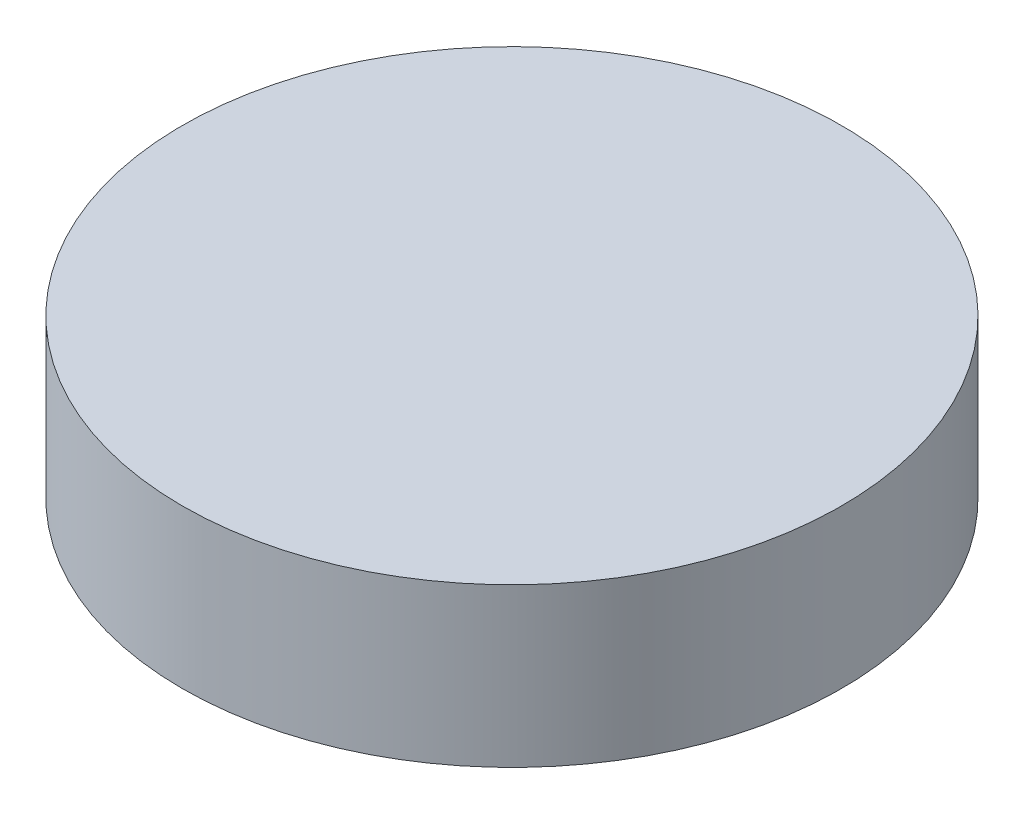
ISO-10303-21;
HEADER;
FILE_DESCRIPTION(('STEP AP214'),'2;1');
FILE_NAME('part.step','',(''),(''),'','','');
FILE_SCHEMA(('AUTOMOTIVE_DESIGN { 1 0 10303 214 1 1 1 1 }'));
ENDSEC;
DATA;
#1=APPLICATION_CONTEXT('core data for automotive mechanical design processes');
#2=APPLICATION_PROTOCOL_DEFINITION('international standard','automotive_design',2000,#1);
#3=PRODUCT_CONTEXT('',#1,'mechanical');
#4=PRODUCT('Part','Part','',(#3));
#5=PRODUCT_RELATED_PRODUCT_CATEGORY('part','',(#4));
#6=PRODUCT_DEFINITION_FORMATION('','',#4);
#7=PRODUCT_DEFINITION_CONTEXT('part definition',#1,'design');
#8=PRODUCT_DEFINITION('design','',#6,#7);
#9=PRODUCT_DEFINITION_SHAPE('','',#8);
#10=(LENGTH_UNIT() NAMED_UNIT(*) SI_UNIT(.MILLI.,.METRE.));
#11=(NAMED_UNIT(*) PLANE_ANGLE_UNIT() SI_UNIT($,.RADIAN.));
#12=(NAMED_UNIT(*) SI_UNIT($,.STERADIAN.) SOLID_ANGLE_UNIT());
#13=UNCERTAINTY_MEASURE_WITH_UNIT(LENGTH_MEASURE(1.E-05),#10,'distance_accuracy_value','');
#14=(GEOMETRIC_REPRESENTATION_CONTEXT(3) GLOBAL_UNCERTAINTY_ASSIGNED_CONTEXT((#13)) GLOBAL_UNIT_ASSIGNED_CONTEXT((#10,
#11,#12)) REPRESENTATION_CONTEXT('',''));
#15=CARTESIAN_POINT('',(0.,0.,0.));
#16=DIRECTION('',(0.,0.,1.));
#17=DIRECTION('',(1.,0.,0.));
#18=AXIS2_PLACEMENT_3D('',#15,#16,#17);
#19=CARTESIAN_POINT('',(0.,3.,0.));
#20=DIRECTION('',(0.,-1.,0.));
#21=DIRECTION('',(0.,0.,-1.));
#22=AXIS2_PLACEMENT_3D('',#19,#20,#21);
#23=CYLINDRICAL_SURFACE('',#22,12.5);
#24=CARTESIAN_POINT('',(0.,3.,0.));
#25=DIRECTION('',(0.,1.,0.));
#26=DIRECTION('',(0.,0.,1.));
#27=AXIS2_PLACEMENT_3D('',#24,#25,#26);
#28=CIRCLE('',#27,12.5);
#29=CARTESIAN_POINT('',(0.,3.,12.5));
#30=VERTEX_POINT('',#29);
#31=EDGE_CURVE('E10',#30,#30,#28,.T.);
#32=ORIENTED_EDGE('',*,*,#31,.F.);
#33=EDGE_LOOP('',(#32));
#34=FACE_BOUND('',#33,.T.);
#35=CARTESIAN_POINT('',(0.,-3.,0.));
#36=DIRECTION('',(0.,1.,0.));
#37=DIRECTION('',(0.,0.,1.));
#38=AXIS2_PLACEMENT_3D('',#35,#36,#37);
#39=CIRCLE('',#38,12.5);
#40=CARTESIAN_POINT('',(0.,-3.,12.5));
#41=VERTEX_POINT('',#40);
#42=EDGE_CURVE('E36',#41,#41,#39,.T.);
#43=ORIENTED_EDGE('',*,*,#42,.T.);
#44=EDGE_LOOP('',(#43));
#45=FACE_BOUND('',#44,.T.);
#46=ADVANCED_FACE('F33',(#34,#45),#23,.T.);
#47=CARTESIAN_POINT('',(0.,3.,0.));
#48=DIRECTION('',(0.,1.,0.));
#49=DIRECTION('',(0.,0.,1.));
#50=AXIS2_PLACEMENT_3D('',#47,#48,#49);
#51=PLANE('',#50);
#52=ORIENTED_EDGE('',*,*,#31,.T.);
#53=EDGE_LOOP('',(#52));
#54=FACE_BOUND('',#53,.T.);
#55=ADVANCED_FACE('F62',(#54),#51,.T.);
#56=CARTESIAN_POINT('',(0.,-3.,0.));
#57=DIRECTION('',(0.,1.,0.));
#58=DIRECTION('',(0.,0.,1.));
#59=AXIS2_PLACEMENT_3D('',#56,#57,#58);
#60=PLANE('',#59);
#61=CARTESIAN_POINT('',(0.,-3.,0.));
#62=DIRECTION('',(0.,-1.,0.));
#63=DIRECTION('',(0.,0.,-1.));
#64=AXIS2_PLACEMENT_3D('',#61,#62,#63);
#65=CIRCLE('',#64,3.);
#66=CARTESIAN_POINT('',(0.,-3.,-3.));
#67=VERTEX_POINT('',#66);
#68=EDGE_CURVE('E45',#67,#67,#65,.T.);
#69=ORIENTED_EDGE('',*,*,#68,.F.);
#70=EDGE_LOOP('',(#69));
#71=FACE_BOUND('',#70,.T.);
#72=ORIENTED_EDGE('',*,*,#42,.F.);
#73=EDGE_LOOP('',(#72));
#74=FACE_BOUND('',#73,.T.);
#75=ADVANCED_FACE('F56',(#71,#74),#60,.F.);
#76=CARTESIAN_POINT('',(0.,0.,0.));
#77=DIRECTION('',(0.,-1.,0.));
#78=DIRECTION('',(0.,0.,-1.));
#79=AXIS2_PLACEMENT_3D('',#76,#77,#78);
#80=CYLINDRICAL_SURFACE('',#79,3.);
#81=CARTESIAN_POINT('',(0.,0.,0.));
#82=DIRECTION('',(0.,-1.,0.));
#83=DIRECTION('',(0.,0.,-1.));
#84=AXIS2_PLACEMENT_3D('',#81,#82,#83);
#85=CIRCLE('',#84,3.);
#86=CARTESIAN_POINT('',(0.,0.,-3.));
#87=VERTEX_POINT('',#86);
#88=EDGE_CURVE('E43',#87,#87,#85,.T.);
#89=ORIENTED_EDGE('',*,*,#88,.F.);
#90=EDGE_LOOP('',(#89));
#91=FACE_BOUND('',#90,.T.);
#92=ORIENTED_EDGE('',*,*,#68,.T.);
#93=EDGE_LOOP('',(#92));
#94=FACE_BOUND('',#93,.T.);
#95=ADVANCED_FACE('F53',(#91,#94),#80,.F.);
#96=CARTESIAN_POINT('',(0.,0.,0.));
#97=DIRECTION('',(0.,-1.,0.));
#98=DIRECTION('',(0.,0.,-1.));
#99=AXIS2_PLACEMENT_3D('',#96,#97,#98);
#100=PLANE('',#99);
#101=ORIENTED_EDGE('',*,*,#88,.T.);
#102=EDGE_LOOP('',(#101));
#103=FACE_BOUND('',#102,.T.);
#104=ADVANCED_FACE('F51',(#103),#100,.T.);
#105=CLOSED_SHELL('',(#46,#55,#75,#95,#104));
#106=MANIFOLD_SOLID_BREP('B2',#105);
#107=ADVANCED_BREP_SHAPE_REPRESENTATION('',(#18,#106),#14);
#108=SHAPE_DEFINITION_REPRESENTATION(#9,#107);
ENDSEC;
END-ISO-10303-21;
